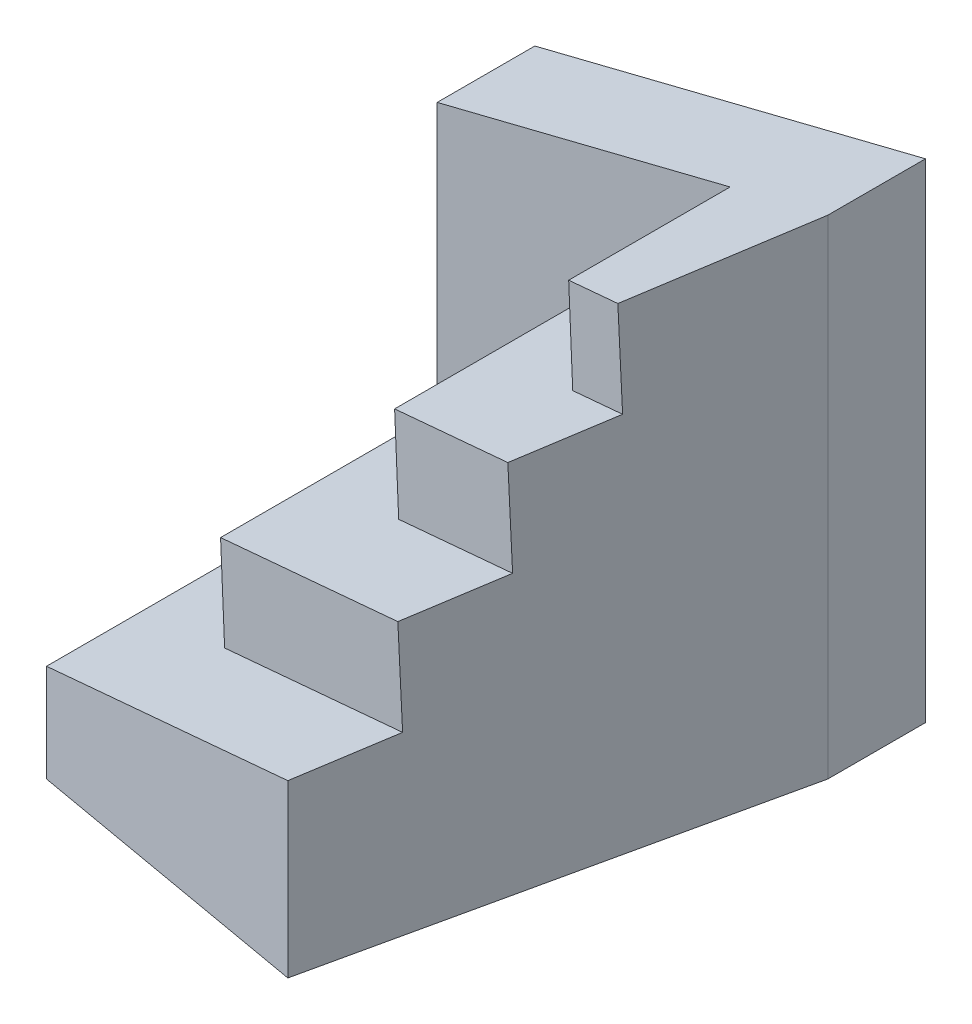
ISO-10303-21;
HEADER;
FILE_DESCRIPTION(('STEP AP214'),'2;1');
FILE_NAME('part.step','',(''),(''),'','','');
FILE_SCHEMA(('AUTOMOTIVE_DESIGN { 1 0 10303 214 1 1 1 1 }'));
ENDSEC;
DATA;
#1=APPLICATION_CONTEXT('core data for automotive mechanical design processes');
#2=APPLICATION_PROTOCOL_DEFINITION('international standard','automotive_design',2000,#1);
#3=PRODUCT_CONTEXT('',#1,'mechanical');
#4=PRODUCT('Part','Part','',(#3));
#5=PRODUCT_RELATED_PRODUCT_CATEGORY('part','',(#4));
#6=PRODUCT_DEFINITION_FORMATION('','',#4);
#7=PRODUCT_DEFINITION_CONTEXT('part definition',#1,'design');
#8=PRODUCT_DEFINITION('design','',#6,#7);
#9=PRODUCT_DEFINITION_SHAPE('','',#8);
#10=(LENGTH_UNIT() NAMED_UNIT(*) SI_UNIT(.MILLI.,.METRE.));
#11=(NAMED_UNIT(*) PLANE_ANGLE_UNIT() SI_UNIT($,.RADIAN.));
#12=(NAMED_UNIT(*) SI_UNIT($,.STERADIAN.) SOLID_ANGLE_UNIT());
#13=UNCERTAINTY_MEASURE_WITH_UNIT(LENGTH_MEASURE(1.E-05),#10,'distance_accuracy_value','');
#14=(GEOMETRIC_REPRESENTATION_CONTEXT(3) GLOBAL_UNCERTAINTY_ASSIGNED_CONTEXT((#13)) GLOBAL_UNIT_ASSIGNED_CONTEXT((#10,
#11,#12)) REPRESENTATION_CONTEXT('',''));
#15=CARTESIAN_POINT('',(0.,0.,0.));
#16=DIRECTION('',(0.,0.,1.));
#17=DIRECTION('',(1.,0.,0.));
#18=AXIS2_PLACEMENT_3D('',#15,#16,#17);
#19=CARTESIAN_POINT('',(72.,90.,-72.));
#20=DIRECTION('',(-0.976480210225794,0.,-0.21560704774517));
#21=DIRECTION('',(-0.21560704774517,0.,0.976480210225795));
#22=AXIS2_PLACEMENT_3D('',#19,#20,#21);
#23=PLANE('',#22);
#24=DIRECTION('',(-0.00882949196754555,0.999161124080437,0.039988600849663));
#25=VECTOR('',#24,1.);
#26=CARTESIAN_POINT('',(64.9965607394729,88.6686702144951,-40.2815570597399));
#27=LINE('',#26,#25);
#28=CARTESIAN_POINT('',(65.1589735704317,70.2897433926079,-41.0171216759093));
#29=VERTEX_POINT('',#28);
#30=CARTESIAN_POINT('',(65.0002599141898,88.2500649785475,-40.2983105515347));
#31=VERTEX_POINT('',#30);
#32=EDGE_CURVE('E156',#29,#31,#27,.T.);
#33=ORIENTED_EDGE('',*,*,#32,.F.);
#34=DIRECTION('',(-0.215294516250489,-0.0538236290626221,0.975064761042567));
#35=VECTOR('',#34,1.);
#36=CARTESIAN_POINT('',(72.2085827792739,72.0521456948185,-72.944667432187));
#37=LINE('',#36,#35);
#38=CARTESIAN_POINT('',(61.3335066094599,69.333376652365,-23.6916547149375));
#39=VERTEX_POINT('',#38);
#40=EDGE_CURVE('E141',#29,#39,#37,.T.);
#41=ORIENTED_EDGE('',*,*,#40,.T.);
#42=DIRECTION('',(-0.00882949196754555,0.999161124080437,0.039988600849663));
#43=VECTOR('',#42,1.);
#44=CARTESIAN_POINT('',(61.1690721219125,87.9410777544648,-22.946934054607));
#45=LINE('',#44,#43);
#46=CARTESIAN_POINT('',(61.4922202657018,51.3730550664254,-24.4104658393121));
#47=VERTEX_POINT('',#46);
#48=EDGE_CURVE('E172',#47,#39,#45,.T.);
#49=ORIENTED_EDGE('',*,*,#48,.F.);
#50=DIRECTION('',(0.215294516250489,0.0538236290626221,-0.975064761042567));
#51=VECTOR('',#50,1.);
#52=CARTESIAN_POINT('',(72.4171655585478,54.1042913896369,-73.889334864374));
#53=LINE('',#52,#51);
#54=CARTESIAN_POINT('',(57.6667533047299,50.4166883261825,-7.08499887834029));
#55=VERTEX_POINT('',#54);
#56=EDGE_CURVE('E166',#55,#47,#53,.T.);
#57=ORIENTED_EDGE('',*,*,#56,.F.);
#58=DIRECTION('',(-0.00882949196754555,0.999161124080436,0.0399886008496629));
#59=VECTOR('',#58,1.);
#60=CARTESIAN_POINT('',(57.341583504352,87.2134852944346,-5.61231104947411));
#61=LINE('',#60,#59);
#62=CARTESIAN_POINT('',(57.8254669609719,32.4563667402429,-7.80381000271497));
#63=VERTEX_POINT('',#62);
#64=EDGE_CURVE('E179',#63,#55,#61,.T.);
#65=ORIENTED_EDGE('',*,*,#64,.F.);
#66=DIRECTION('',(0.215294516250489,0.0538236290626221,-0.975064761042567));
#67=VECTOR('',#66,1.);
#68=CARTESIAN_POINT('',(72.6257483378217,36.1564370844554,-74.834002296561));
#69=LINE('',#68,#67);
#70=CARTESIAN_POINT('',(54.,31.5,9.52165695825689));
#71=VERTEX_POINT('',#70);
#72=EDGE_CURVE('E187',#71,#63,#69,.T.);
#73=ORIENTED_EDGE('',*,*,#72,.F.);
#74=DIRECTION('',(0.,-1.,0.));
#75=VECTOR('',#74,1.);
#76=CARTESIAN_POINT('',(54.,90.,9.52165695825689));
#77=LINE('',#76,#75);
#78=CARTESIAN_POINT('',(54.,0.,9.52165695825689));
#79=VERTEX_POINT('',#78);
#80=EDGE_CURVE('E254',#71,#79,#77,.T.);
#81=ORIENTED_EDGE('',*,*,#80,.T.);
#82=DIRECTION('',(0.21560704774517,0.,-0.976480210225795));
#83=VECTOR('',#82,1.);
#84=CARTESIAN_POINT('',(72.,0.,-72.));
#85=LINE('',#84,#83);
#86=CARTESIAN_POINT('',(72.,0.,-72.));
#87=VERTEX_POINT('',#86);
#88=EDGE_CURVE('E234',#79,#87,#85,.T.);
#89=ORIENTED_EDGE('',*,*,#88,.T.);
#90=DIRECTION('',(0.,-1.,0.));
#91=VECTOR('',#90,1.);
#92=CARTESIAN_POINT('',(72.,90.,-72.));
#93=LINE('',#92,#91);
#94=CARTESIAN_POINT('',(72.,90.,-72.));
#95=VERTEX_POINT('',#94);
#96=EDGE_CURVE('E251',#95,#87,#93,.T.);
#97=ORIENTED_EDGE('',*,*,#96,.F.);
#98=DIRECTION('',(-0.215294516250489,-0.0538236290626221,0.975064761042566));
#99=VECTOR('',#98,1.);
#100=CARTESIAN_POINT('',(72.,90.,-72.));
#101=LINE('',#100,#99);
#102=EDGE_CURVE('E162',#95,#31,#101,.T.);
#103=ORIENTED_EDGE('',*,*,#102,.T.);
#104=EDGE_LOOP('',(#33,#41,#49,#57,#65,#73,#81,#89,#97,#103));
#105=FACE_BOUND('',#104,.T.);
#106=ADVANCED_FACE('F32',(#105),#23,.F.);
#107=CARTESIAN_POINT('',(54.,90.,-72.));
#108=DIRECTION('',(1.,0.,0.));
#109=DIRECTION('',(0.,1.,0.));
#110=AXIS2_PLACEMENT_3D('',#107,#108,#109);
#111=PLANE('',#110);
#112=DIRECTION('',(0.,-0.999140453332606,-0.0414530398681932));
#113=VECTOR('',#112,1.);
#114=CARTESIAN_POINT('',(54.,88.759600537051,-42.1027165760323));
#115=LINE('',#114,#113);
#116=CARTESIAN_POINT('',(54.,85.5,-42.2379531692121));
#117=VERTEX_POINT('',#116);
#118=CARTESIAN_POINT('',(54.,67.5,-42.9847497933891));
#119=VERTEX_POINT('',#118);
#120=EDGE_CURVE('E152',#117,#119,#115,.T.);
#121=ORIENTED_EDGE('',*,*,#120,.F.);
#122=DIRECTION('',(0.,0.,-1.));
#123=VECTOR('',#122,1.);
#124=CARTESIAN_POINT('',(54.,85.5,-72.));
#125=LINE('',#124,#123);
#126=CARTESIAN_POINT('',(54.,85.5,-72.));
#127=VERTEX_POINT('',#126);
#128=EDGE_CURVE('E193',#117,#127,#125,.T.);
#129=ORIENTED_EDGE('',*,*,#128,.T.);
#130=DIRECTION('',(0.,1.,0.));
#131=VECTOR('',#130,1.);
#132=CARTESIAN_POINT('',(54.,90.,-72.));
#133=LINE('',#132,#131);
#134=CARTESIAN_POINT('',(54.,67.5,-72.));
#135=VERTEX_POINT('',#134);
#136=EDGE_CURVE('E211',#135,#127,#133,.T.);
#137=ORIENTED_EDGE('',*,*,#136,.F.);
#138=DIRECTION('',(0.,0.,1.));
#139=VECTOR('',#138,1.);
#140=CARTESIAN_POINT('',(54.,67.5,-72.));
#141=LINE('',#140,#139);
#142=EDGE_CURVE('E220',#135,#119,#141,.T.);
#143=ORIENTED_EDGE('',*,*,#142,.T.);
#144=EDGE_LOOP('',(#121,#129,#137,#143));
#145=FACE_BOUND('',#144,.T.);
#146=ADVANCED_FACE('F285',(#145),#111,.F.);
#147=CARTESIAN_POINT('',(0.,72.,-90.));
#148=DIRECTION('',(0.242535625036333,-0.970142500145332,0.));
#149=DIRECTION('',(0.970142500145332,0.242535625036333,0.));
#150=AXIS2_PLACEMENT_3D('',#147,#148,#149);
#151=PLANE('',#150);
#152=DIRECTION('',(-0.95625230663687,-0.239063076659217,-0.168613082024781));
#153=VECTOR('',#152,1.);
#154=CARTESIAN_POINT('',(-6.16575230479121,70.4585619238022,-52.846798615169));
#155=LINE('',#154,#153);
#156=EDGE_CURVE('E11',#31,#117,#155,.T.);
#157=ORIENTED_EDGE('',*,*,#156,.F.);
#158=ORIENTED_EDGE('',*,*,#102,.F.);
#159=DIRECTION('',(0.,0.,-1.));
#160=VECTOR('',#159,1.);
#161=CARTESIAN_POINT('',(72.,90.,-90.));
#162=LINE('',#161,#160);
#163=CARTESIAN_POINT('',(72.,90.,-90.));
#164=VERTEX_POINT('',#163);
#165=EDGE_CURVE('E243',#95,#164,#162,.T.);
#166=ORIENTED_EDGE('',*,*,#165,.T.);
#167=DIRECTION('',(0.970142500145332,0.242535625036333,0.));
#168=VECTOR('',#167,1.);
#169=CARTESIAN_POINT('',(0.,72.,-90.));
#170=LINE('',#169,#168);
#171=CARTESIAN_POINT('',(0.,72.,-90.));
#172=VERTEX_POINT('',#171);
#173=EDGE_CURVE('E189',#172,#164,#170,.T.);
#174=ORIENTED_EDGE('',*,*,#173,.F.);
#175=DIRECTION('',(0.,0.,1.));
#176=VECTOR('',#175,1.);
#177=CARTESIAN_POINT('',(0.,72.,-90.));
#178=LINE('',#177,#176);
#179=CARTESIAN_POINT('',(0.,72.,-72.));
#180=VERTEX_POINT('',#179);
#181=EDGE_CURVE('E47',#172,#180,#178,.T.);
#182=ORIENTED_EDGE('',*,*,#181,.T.);
#183=DIRECTION('',(-0.970142500145332,-0.242535625036333,0.));
#184=VECTOR('',#183,1.);
#185=CARTESIAN_POINT('',(41.2941176470589,82.3235294117647,-72.));
#186=LINE('',#185,#184);
#187=EDGE_CURVE('E40',#127,#180,#186,.T.);
#188=ORIENTED_EDGE('',*,*,#187,.F.);
#189=ORIENTED_EDGE('',*,*,#128,.F.);
#190=EDGE_LOOP('',(#157,#158,#166,#174,#182,#188,#189));
#191=FACE_BOUND('',#190,.T.);
#192=ADVANCED_FACE('F283',(#191),#151,.F.);
#193=CARTESIAN_POINT('',(36.,63.,-72.));
#194=DIRECTION('',(0.242535625036333,-0.970142500145332,0.));
#195=DIRECTION('',(0.970142500145332,0.242535625036333,0.));
#196=AXIS2_PLACEMENT_3D('',#193,#194,#195);
#197=PLANE('',#196);
#198=DIRECTION('',(-0.95625230663687,-0.239063076659217,-0.168613082024781));
#199=VECTOR('',#198,1.);
#200=CARTESIAN_POINT('',(28.9311653086121,61.232791327153,-29.405061724401));
#201=LINE('',#200,#199);
#202=CARTESIAN_POINT('',(36.,63.,-28.1586354461414));
#203=VERTEX_POINT('',#202);
#204=EDGE_CURVE('E147',#39,#203,#201,.T.);
#205=ORIENTED_EDGE('',*,*,#204,.F.);
#206=ORIENTED_EDGE('',*,*,#40,.F.);
#207=DIRECTION('',(-0.95625230663687,-0.239063076659217,-0.168613082024781));
#208=VECTOR('',#207,1.);
#209=CARTESIAN_POINT('',(36.,63.,-46.1586354461414));
#210=LINE('',#209,#208);
#211=EDGE_CURVE('E144',#29,#119,#210,.T.);
#212=ORIENTED_EDGE('',*,*,#211,.T.);
#213=ORIENTED_EDGE('',*,*,#142,.F.);
#214=DIRECTION('',(0.970142500145332,0.242535625036333,0.));
#215=VECTOR('',#214,1.);
#216=CARTESIAN_POINT('',(36.,63.,-72.));
#217=LINE('',#216,#215);
#218=CARTESIAN_POINT('',(36.,63.,-72.));
#219=VERTEX_POINT('',#218);
#220=EDGE_CURVE('E208',#219,#135,#217,.T.);
#221=ORIENTED_EDGE('',*,*,#220,.F.);
#222=DIRECTION('',(0.,0.,1.));
#223=VECTOR('',#222,1.);
#224=CARTESIAN_POINT('',(36.,63.,-72.));
#225=LINE('',#224,#223);
#226=EDGE_CURVE('E222',#219,#203,#225,.T.);
#227=ORIENTED_EDGE('',*,*,#226,.T.);
#228=EDGE_LOOP('',(#205,#206,#212,#213,#221,#227));
#229=FACE_BOUND('',#228,.T.);
#230=ADVANCED_FACE('F143',(#229),#197,.F.);
#231=CARTESIAN_POINT('',(36.,63.,-72.));
#232=DIRECTION('',(1.,0.,0.));
#233=DIRECTION('',(0.,1.,0.));
#234=AXIS2_PLACEMENT_3D('',#231,#232,#233);
#235=PLANE('',#234);
#236=DIRECTION('',(0.,-0.999140453332606,-0.0414530398681932));
#237=VECTOR('',#236,1.);
#238=CARTESIAN_POINT('',(36.,61.1842042711415,-28.2339704528362));
#239=LINE('',#238,#237);
#240=CARTESIAN_POINT('',(36.,45.,-28.9054320703184));
#241=VERTEX_POINT('',#240);
#242=EDGE_CURVE('E174',#203,#241,#239,.T.);
#243=ORIENTED_EDGE('',*,*,#242,.F.);
#244=ORIENTED_EDGE('',*,*,#226,.F.);
#245=DIRECTION('',(0.,1.,0.));
#246=VECTOR('',#245,1.);
#247=CARTESIAN_POINT('',(36.,63.,-72.));
#248=LINE('',#247,#246);
#249=CARTESIAN_POINT('',(36.,45.,-72.));
#250=VERTEX_POINT('',#249);
#251=EDGE_CURVE('E205',#250,#219,#248,.T.);
#252=ORIENTED_EDGE('',*,*,#251,.F.);
#253=DIRECTION('',(0.,0.,1.));
#254=VECTOR('',#253,1.);
#255=CARTESIAN_POINT('',(36.,45.,-72.));
#256=LINE('',#255,#254);
#257=EDGE_CURVE('E224',#250,#241,#256,.T.);
#258=ORIENTED_EDGE('',*,*,#257,.T.);
#259=EDGE_LOOP('',(#243,#244,#252,#258));
#260=FACE_BOUND('',#259,.T.);
#261=ADVANCED_FACE('F291',(#260),#235,.F.);
#262=CARTESIAN_POINT('',(-21.82820625327,105.31282501308,-18.));
#263=DIRECTION('',(-0.163578716952731,-0.0408946792381826,0.985682316251085));
#264=DIRECTION('',(0.986507566619716,0.,0.16371567121704));
#265=AXIS2_PLACEMENT_3D('',#262,#263,#264);
#266=PLANE('',#265);
#267=ORIENTED_EDGE('',*,*,#64,.T.);
#268=DIRECTION('',(-0.95625230663687,-0.239063076659217,-0.168613082024781));
#269=VECTOR('',#268,1.);
#270=CARTESIAN_POINT('',(8.66106330415353,38.1652658260384,-15.7260242336767));
#271=LINE('',#270,#269);
#272=CARTESIAN_POINT('',(18.,40.5,-14.0793177230707));
#273=VERTEX_POINT('',#272);
#274=EDGE_CURVE('E182',#55,#273,#271,.T.);
#275=ORIENTED_EDGE('',*,*,#274,.T.);
#276=DIRECTION('',(0.,-0.999140453332606,-0.0414530398681932));
#277=VECTOR('',#276,1.);
#278=CARTESIAN_POINT('',(18.,38.1010754099176,-14.1788459889334));
#279=LINE('',#278,#277);
#280=CARTESIAN_POINT('',(18.,22.5,-14.8261143472477));
#281=VERTEX_POINT('',#280);
#282=EDGE_CURVE('E185',#273,#281,#279,.T.);
#283=ORIENTED_EDGE('',*,*,#282,.T.);
#284=DIRECTION('',(-0.95625230663687,-0.239063076659217,-0.168613082024781));
#285=VECTOR('',#284,1.);
#286=CARTESIAN_POINT('',(0.,18.,-18.));
#287=LINE('',#286,#285);
#288=EDGE_CURVE('E176',#63,#281,#287,.T.);
#289=ORIENTED_EDGE('',*,*,#288,.F.);
#290=EDGE_LOOP('',(#267,#275,#283,#289));
#291=FACE_BOUND('',#290,.T.);
#292=ADVANCED_FACE('F300',(#291),#266,.T.);
#293=CARTESIAN_POINT('',(54.,90.,9.52165695825689));
#294=DIRECTION('',(0.173648177666926,0.,-0.984807753012209));
#295=DIRECTION('',(-0.984807753012209,0.,-0.173648177666927));
#296=AXIS2_PLACEMENT_3D('',#293,#294,#295);
#297=PLANE('',#296);
#298=ORIENTED_EDGE('',*,*,#80,.F.);
#299=DIRECTION('',(-0.95625230663687,-0.239063076659217,-0.168613082024781));
#300=VECTOR('',#299,1.);
#301=CARTESIAN_POINT('',(67.3733701814944,34.8433425453736,11.8797429442564));
#302=LINE('',#301,#300);
#303=CARTESIAN_POINT('',(0.,18.,0.));
#304=VERTEX_POINT('',#303);
#305=EDGE_CURVE('E219',#71,#304,#302,.T.);
#306=ORIENTED_EDGE('',*,*,#305,.T.);
#307=DIRECTION('',(0.,-1.,0.));
#308=VECTOR('',#307,1.);
#309=CARTESIAN_POINT('',(0.,90.,0.));
#310=LINE('',#309,#308);
#311=CARTESIAN_POINT('',(0.,0.,0.));
#312=VERTEX_POINT('',#311);
#313=EDGE_CURVE('E55',#304,#312,#310,.T.);
#314=ORIENTED_EDGE('',*,*,#313,.T.);
#315=DIRECTION('',(0.984807753012209,0.,0.173648177666927));
#316=VECTOR('',#315,1.);
#317=CARTESIAN_POINT('',(54.,0.,9.52165695825689));
#318=LINE('',#317,#316);
#319=EDGE_CURVE('E232',#312,#79,#318,.T.);
#320=ORIENTED_EDGE('',*,*,#319,.T.);
#321=EDGE_LOOP('',(#298,#306,#314,#320));
#322=FACE_BOUND('',#321,.T.);
#323=ADVANCED_FACE('F34',(#322),#297,.F.);
#324=CARTESIAN_POINT('',(18.,40.5,-72.));
#325=DIRECTION('',(0.242535625036333,-0.970142500145332,0.));
#326=DIRECTION('',(0.970142500145332,0.242535625036333,0.));
#327=AXIS2_PLACEMENT_3D('',#324,#325,#326);
#328=PLANE('',#327);
#329=ORIENTED_EDGE('',*,*,#274,.F.);
#330=ORIENTED_EDGE('',*,*,#56,.T.);
#331=DIRECTION('',(-0.95625230663687,-0.239063076659217,-0.168613082024781));
#332=VECTOR('',#331,1.);
#333=CARTESIAN_POINT('',(18.,40.5,-32.0793177230707));
#334=LINE('',#333,#332);
#335=EDGE_CURVE('E163',#47,#241,#334,.T.);
#336=ORIENTED_EDGE('',*,*,#335,.T.);
#337=ORIENTED_EDGE('',*,*,#257,.F.);
#338=DIRECTION('',(0.970142500145332,0.242535625036333,0.));
#339=VECTOR('',#338,1.);
#340=CARTESIAN_POINT('',(18.,40.5,-72.));
#341=LINE('',#340,#339);
#342=CARTESIAN_POINT('',(18.,40.5,-72.));
#343=VERTEX_POINT('',#342);
#344=EDGE_CURVE('E202',#343,#250,#341,.T.);
#345=ORIENTED_EDGE('',*,*,#344,.F.);
#346=DIRECTION('',(0.,0.,1.));
#347=VECTOR('',#346,1.);
#348=CARTESIAN_POINT('',(18.,40.5,-72.));
#349=LINE('',#348,#347);
#350=EDGE_CURVE('E227',#343,#273,#349,.T.);
#351=ORIENTED_EDGE('',*,*,#350,.T.);
#352=EDGE_LOOP('',(#329,#330,#336,#337,#345,#351));
#353=FACE_BOUND('',#352,.T.);
#354=ADVANCED_FACE('F296',(#353),#328,.F.);
#355=CARTESIAN_POINT('',(18.,40.5,-72.));
#356=DIRECTION('',(1.,0.,0.));
#357=DIRECTION('',(0.,0.,-1.));
#358=AXIS2_PLACEMENT_3D('',#355,#356,#357);
#359=PLANE('',#358);
#360=ORIENTED_EDGE('',*,*,#282,.F.);
#361=ORIENTED_EDGE('',*,*,#350,.F.);
#362=DIRECTION('',(0.,1.,0.));
#363=VECTOR('',#362,1.);
#364=CARTESIAN_POINT('',(18.,40.5,-72.));
#365=LINE('',#364,#363);
#366=CARTESIAN_POINT('',(18.,22.5,-72.));
#367=VERTEX_POINT('',#366);
#368=EDGE_CURVE('E199',#367,#343,#365,.T.);
#369=ORIENTED_EDGE('',*,*,#368,.F.);
#370=DIRECTION('',(0.,0.,1.));
#371=VECTOR('',#370,1.);
#372=CARTESIAN_POINT('',(18.,22.5,-72.));
#373=LINE('',#372,#371);
#374=EDGE_CURVE('E216',#367,#281,#373,.T.);
#375=ORIENTED_EDGE('',*,*,#374,.T.);
#376=EDGE_LOOP('',(#360,#361,#369,#375));
#377=FACE_BOUND('',#376,.T.);
#378=ADVANCED_FACE('F304',(#377),#359,.F.);
#379=CARTESIAN_POINT('',(72.,90.,-90.));
#380=DIRECTION('',(-1.,0.,0.));
#381=DIRECTION('',(0.,0.,1.));
#382=AXIS2_PLACEMENT_3D('',#379,#380,#381);
#383=PLANE('',#382);
#384=DIRECTION('',(0.,0.,-1.));
#385=VECTOR('',#384,1.);
#386=CARTESIAN_POINT('',(72.,0.,-90.));
#387=LINE('',#386,#385);
#388=CARTESIAN_POINT('',(72.,0.,-90.));
#389=VERTEX_POINT('',#388);
#390=EDGE_CURVE('E236',#87,#389,#387,.T.);
#391=ORIENTED_EDGE('',*,*,#390,.T.);
#392=DIRECTION('',(0.,-1.,0.));
#393=VECTOR('',#392,1.);
#394=CARTESIAN_POINT('',(72.,90.,-90.));
#395=LINE('',#394,#393);
#396=EDGE_CURVE('E248',#164,#389,#395,.T.);
#397=ORIENTED_EDGE('',*,*,#396,.F.);
#398=ORIENTED_EDGE('',*,*,#165,.F.);
#399=ORIENTED_EDGE('',*,*,#96,.T.);
#400=EDGE_LOOP('',(#391,#397,#398,#399));
#401=FACE_BOUND('',#400,.T.);
#402=ADVANCED_FACE('F279',(#401),#383,.F.);
#403=CARTESIAN_POINT('',(0.,90.,-90.));
#404=DIRECTION('',(0.,0.,1.));
#405=DIRECTION('',(1.,0.,0.));
#406=AXIS2_PLACEMENT_3D('',#403,#404,#405);
#407=PLANE('',#406);
#408=DIRECTION('',(0.,-1.,0.));
#409=VECTOR('',#408,1.);
#410=CARTESIAN_POINT('',(0.,90.,-90.));
#411=LINE('',#410,#409);
#412=CARTESIAN_POINT('',(0.,0.,-90.));
#413=VERTEX_POINT('',#412);
#414=EDGE_CURVE('E246',#172,#413,#411,.T.);
#415=ORIENTED_EDGE('',*,*,#414,.F.);
#416=ORIENTED_EDGE('',*,*,#173,.T.);
#417=ORIENTED_EDGE('',*,*,#396,.T.);
#418=DIRECTION('',(-1.,0.,0.));
#419=VECTOR('',#418,1.);
#420=CARTESIAN_POINT('',(0.,0.,-90.));
#421=LINE('',#420,#419);
#422=EDGE_CURVE('E238',#389,#413,#421,.T.);
#423=ORIENTED_EDGE('',*,*,#422,.T.);
#424=EDGE_LOOP('',(#415,#416,#417,#423));
#425=FACE_BOUND('',#424,.T.);
#426=ADVANCED_FACE('F282',(#425),#407,.F.);
#427=CARTESIAN_POINT('',(0.,90.,0.));
#428=DIRECTION('',(1.,0.,0.));
#429=DIRECTION('',(0.,0.,-1.));
#430=AXIS2_PLACEMENT_3D('',#427,#428,#429);
#431=PLANE('',#430);
#432=DIRECTION('',(0.,-1.,0.));
#433=VECTOR('',#432,1.);
#434=CARTESIAN_POINT('',(0.,90.,-72.));
#435=LINE('',#434,#433);
#436=CARTESIAN_POINT('',(0.,18.,-72.));
#437=VERTEX_POINT('',#436);
#438=EDGE_CURVE('E214',#180,#437,#435,.T.);
#439=ORIENTED_EDGE('',*,*,#438,.F.);
#440=ORIENTED_EDGE('',*,*,#181,.F.);
#441=ORIENTED_EDGE('',*,*,#414,.T.);
#442=DIRECTION('',(0.,0.,1.));
#443=VECTOR('',#442,1.);
#444=CARTESIAN_POINT('',(0.,0.,0.));
#445=LINE('',#444,#443);
#446=EDGE_CURVE('E241',#413,#312,#445,.T.);
#447=ORIENTED_EDGE('',*,*,#446,.T.);
#448=ORIENTED_EDGE('',*,*,#313,.F.);
#449=DIRECTION('',(0.,0.,1.));
#450=VECTOR('',#449,1.);
#451=CARTESIAN_POINT('',(0.,18.,-72.));
#452=LINE('',#451,#450);
#453=EDGE_CURVE('E217',#437,#304,#452,.T.);
#454=ORIENTED_EDGE('',*,*,#453,.F.);
#455=EDGE_LOOP('',(#439,#440,#441,#447,#448,#454));
#456=FACE_BOUND('',#455,.T.);
#457=ADVANCED_FACE('F263',(#456),#431,.F.);
#458=CARTESIAN_POINT('',(54.,0.,9.52165695825689));
#459=DIRECTION('',(0.,1.,0.));
#460=DIRECTION('',(0.,0.,1.));
#461=AXIS2_PLACEMENT_3D('',#458,#459,#460);
#462=PLANE('',#461);
#463=ORIENTED_EDGE('',*,*,#319,.F.);
#464=ORIENTED_EDGE('',*,*,#446,.F.);
#465=ORIENTED_EDGE('',*,*,#422,.F.);
#466=ORIENTED_EDGE('',*,*,#390,.F.);
#467=ORIENTED_EDGE('',*,*,#88,.F.);
#468=EDGE_LOOP('',(#463,#464,#465,#466,#467));
#469=FACE_BOUND('',#468,.T.);
#470=ADVANCED_FACE('F274',(#469),#462,.F.);
#471=CARTESIAN_POINT('',(0.,18.,-72.));
#472=DIRECTION('',(0.242535625036333,-0.970142500145332,0.));
#473=DIRECTION('',(0.970142500145332,0.242535625036333,0.));
#474=AXIS2_PLACEMENT_3D('',#471,#472,#473);
#475=PLANE('',#474);
#476=ORIENTED_EDGE('',*,*,#305,.F.);
#477=ORIENTED_EDGE('',*,*,#72,.T.);
#478=ORIENTED_EDGE('',*,*,#288,.T.);
#479=ORIENTED_EDGE('',*,*,#374,.F.);
#480=DIRECTION('',(0.970142500145332,0.242535625036333,0.));
#481=VECTOR('',#480,1.);
#482=CARTESIAN_POINT('',(0.,18.,-72.));
#483=LINE('',#482,#481);
#484=EDGE_CURVE('E196',#437,#367,#483,.T.);
#485=ORIENTED_EDGE('',*,*,#484,.F.);
#486=ORIENTED_EDGE('',*,*,#453,.T.);
#487=EDGE_LOOP('',(#476,#477,#478,#479,#485,#486));
#488=FACE_BOUND('',#487,.T.);
#489=ADVANCED_FACE('F266',(#488),#475,.F.);
#490=CARTESIAN_POINT('',(54.,31.5,-72.));
#491=DIRECTION('',(0.,0.,-1.));
#492=DIRECTION('',(-1.,0.,0.));
#493=AXIS2_PLACEMENT_3D('',#490,#491,#492);
#494=PLANE('',#493);
#495=ORIENTED_EDGE('',*,*,#136,.T.);
#496=ORIENTED_EDGE('',*,*,#187,.T.);
#497=ORIENTED_EDGE('',*,*,#438,.T.);
#498=ORIENTED_EDGE('',*,*,#484,.T.);
#499=ORIENTED_EDGE('',*,*,#368,.T.);
#500=ORIENTED_EDGE('',*,*,#344,.T.);
#501=ORIENTED_EDGE('',*,*,#251,.T.);
#502=ORIENTED_EDGE('',*,*,#220,.T.);
#503=EDGE_LOOP('',(#495,#496,#497,#498,#499,#500,#501,#502));
#504=FACE_BOUND('',#503,.T.);
#505=ADVANCED_FACE('F257',(#504),#494,.F.);
#506=CARTESIAN_POINT('',(5.87321874818336,89.0071250072666,-32.0793177230707));
#507=DIRECTION('',(-0.163578716952731,-0.0408946792381826,0.985682316251085));
#508=DIRECTION('',(0.986507566619716,0.,0.16371567121704));
#509=AXIS2_PLACEMENT_3D('',#506,#507,#508);
#510=PLANE('',#509);
#511=ORIENTED_EDGE('',*,*,#48,.T.);
#512=ORIENTED_EDGE('',*,*,#204,.T.);
#513=ORIENTED_EDGE('',*,*,#242,.T.);
#514=ORIENTED_EDGE('',*,*,#335,.F.);
#515=EDGE_LOOP('',(#511,#512,#513,#514));
#516=FACE_BOUND('',#515,.T.);
#517=ADVANCED_FACE('F294',(#516),#510,.T.);
#518=CARTESIAN_POINT('',(31.1492874992733,82.4028500029066,-46.1586354461414));
#519=DIRECTION('',(-0.163578716952731,-0.0408946792381826,0.985682316251085));
#520=DIRECTION('',(0.986507566619716,0.,0.16371567121704));
#521=AXIS2_PLACEMENT_3D('',#518,#519,#520);
#522=PLANE('',#521);
#523=ORIENTED_EDGE('',*,*,#32,.T.);
#524=ORIENTED_EDGE('',*,*,#156,.T.);
#525=ORIENTED_EDGE('',*,*,#120,.T.);
#526=ORIENTED_EDGE('',*,*,#211,.F.);
#527=EDGE_LOOP('',(#523,#524,#525,#526));
#528=FACE_BOUND('',#527,.T.);
#529=ADVANCED_FACE('F155',(#528),#522,.T.);
#530=CLOSED_SHELL('',(#106,#146,#192,#230,#261,#292,#323,#354,#378,#402,#426,#457,#470,#489,
#505,#517,#529));
#531=MANIFOLD_SOLID_BREP('B2',#530);
#532=ADVANCED_BREP_SHAPE_REPRESENTATION('',(#18,#531),#14);
#533=SHAPE_DEFINITION_REPRESENTATION(#9,#532);
ENDSEC;
END-ISO-10303-21;
